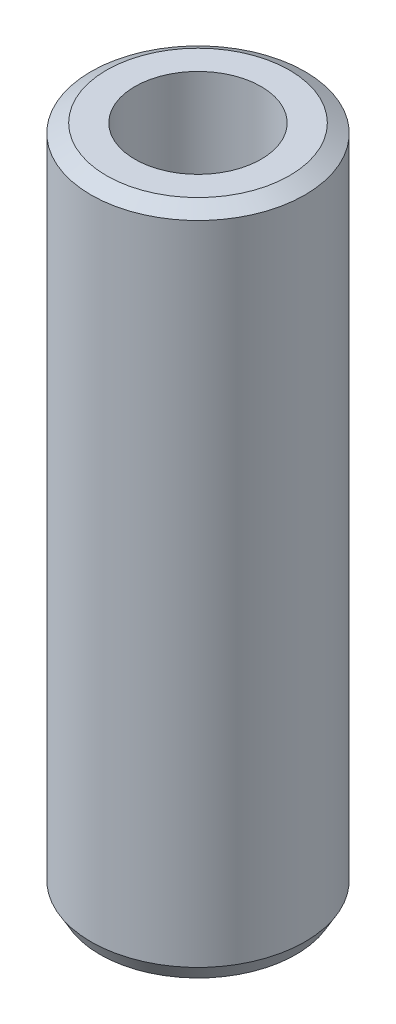
ISO-10303-21;
HEADER;
FILE_DESCRIPTION(('STEP AP214'),'2;1');
FILE_NAME('part.step','',(''),(''),'','','');
FILE_SCHEMA(('AUTOMOTIVE_DESIGN { 1 0 10303 214 1 1 1 1 }'));
ENDSEC;
DATA;
#1=APPLICATION_CONTEXT('core data for automotive mechanical design processes');
#2=APPLICATION_PROTOCOL_DEFINITION('international standard','automotive_design',2000,#1);
#3=PRODUCT_CONTEXT('',#1,'mechanical');
#4=PRODUCT('Part','Part','',(#3));
#5=PRODUCT_RELATED_PRODUCT_CATEGORY('part','',(#4));
#6=PRODUCT_DEFINITION_FORMATION('','',#4);
#7=PRODUCT_DEFINITION_CONTEXT('part definition',#1,'design');
#8=PRODUCT_DEFINITION('design','',#6,#7);
#9=PRODUCT_DEFINITION_SHAPE('','',#8);
#10=(LENGTH_UNIT() NAMED_UNIT(*) SI_UNIT(.MILLI.,.METRE.));
#11=(NAMED_UNIT(*) PLANE_ANGLE_UNIT() SI_UNIT($,.RADIAN.));
#12=(NAMED_UNIT(*) SI_UNIT($,.STERADIAN.) SOLID_ANGLE_UNIT());
#13=UNCERTAINTY_MEASURE_WITH_UNIT(LENGTH_MEASURE(1.E-05),#10,'distance_accuracy_value','');
#14=(GEOMETRIC_REPRESENTATION_CONTEXT(3) GLOBAL_UNCERTAINTY_ASSIGNED_CONTEXT((#13)) GLOBAL_UNIT_ASSIGNED_CONTEXT((#10,
#11,#12)) REPRESENTATION_CONTEXT('',''));
#15=CARTESIAN_POINT('',(0.,0.,0.));
#16=DIRECTION('',(0.,0.,1.));
#17=DIRECTION('',(1.,0.,0.));
#18=AXIS2_PLACEMENT_3D('',#15,#16,#17);
#19=CARTESIAN_POINT('',(0.,376.550034024088,0.));
#20=DIRECTION('',(0.,-1.,0.));
#21=DIRECTION('',(0.,0.,-1.));
#22=AXIS2_PLACEMENT_3D('',#19,#20,#21);
#23=CYLINDRICAL_SURFACE('',#22,60.);
#24=CARTESIAN_POINT('',(0.,371.536651698414,0.));
#25=DIRECTION('',(0.,1.,0.));
#26=DIRECTION('',(0.,0.,1.));
#27=AXIS2_PLACEMENT_3D('',#24,#25,#26);
#28=CIRCLE('',#27,60.);
#29=CARTESIAN_POINT('',(0.,371.536651698413,-60.));
#30=VERTEX_POINT('',#29);
#31=EDGE_CURVE('E50',#30,#30,#28,.F.);
#32=CARTESIAN_POINT('',(0.,8.68343290583662,0.));
#33=DIRECTION('',(0.,1.,0.));
#34=DIRECTION('',(0.,0.,1.));
#35=AXIS2_PLACEMENT_3D('',#32,#33,#34);
#36=CIRCLE('',#35,60.);
#37=CARTESIAN_POINT('',(0.,8.68343290583656,-60.));
#38=VERTEX_POINT('',#37);
#39=EDGE_CURVE('E51',#38,#38,#36,.T.);
#40=CARTESIAN_POINT('',(0.,371.536651698413,-60.));
#41=CARTESIAN_POINT('',(0.,367.756930669324,-60.));
#42=CARTESIAN_POINT('',(0.,363.977209640235,-60.));
#43=CARTESIAN_POINT('',(0.,356.417767582056,-60.));
#44=CARTESIAN_POINT('',(0.,352.638046552967,-60.));
#45=CARTESIAN_POINT('',(0.,345.078604494788,-60.));
#46=CARTESIAN_POINT('',(0.,341.298883465699,-60.));
#47=CARTESIAN_POINT('',(0.,333.73944140752,-60.));
#48=CARTESIAN_POINT('',(0.,329.959720378431,-60.));
#49=CARTESIAN_POINT('',(0.,322.400278320252,-60.));
#50=CARTESIAN_POINT('',(0.,318.620557291163,-60.));
#51=CARTESIAN_POINT('',(0.,311.061115232984,-60.));
#52=CARTESIAN_POINT('',(0.,307.281394203895,-60.));
#53=CARTESIAN_POINT('',(0.,299.721952145716,-60.));
#54=CARTESIAN_POINT('',(0.,295.942231116627,-60.));
#55=CARTESIAN_POINT('',(0.,288.382789058448,-60.));
#56=CARTESIAN_POINT('',(0.,284.603068029359,-60.));
#57=CARTESIAN_POINT('',(0.,277.04362597118,-60.));
#58=CARTESIAN_POINT('',(0.,273.263904942091,-60.));
#59=CARTESIAN_POINT('',(0.,265.704462883912,-60.));
#60=CARTESIAN_POINT('',(0.,261.924741854823,-60.));
#61=CARTESIAN_POINT('',(0.,254.365299796644,-60.));
#62=CARTESIAN_POINT('',(0.,250.585578767555,-60.));
#63=CARTESIAN_POINT('',(0.,243.026136709376,-60.));
#64=CARTESIAN_POINT('',(0.,239.246415680287,-60.));
#65=CARTESIAN_POINT('',(0.,231.686973622108,-60.));
#66=CARTESIAN_POINT('',(0.,227.907252593019,-60.));
#67=CARTESIAN_POINT('',(0.,220.34781053484,-60.));
#68=CARTESIAN_POINT('',(0.,216.56808950575,-60.));
#69=CARTESIAN_POINT('',(0.,209.008647447572,-60.));
#70=CARTESIAN_POINT('',(0.,205.228926418482,-60.));
#71=CARTESIAN_POINT('',(0.,197.669484360304,-60.));
#72=CARTESIAN_POINT('',(0.,193.889763331214,-60.));
#73=CARTESIAN_POINT('',(0.,186.330321273036,-60.));
#74=CARTESIAN_POINT('',(0.,182.550600243946,-60.));
#75=CARTESIAN_POINT('',(0.,174.991158185768,-60.));
#76=CARTESIAN_POINT('',(0.,171.211437156678,-60.));
#77=CARTESIAN_POINT('',(0.,163.6519950985,-60.));
#78=CARTESIAN_POINT('',(0.,159.87227406941,-60.));
#79=CARTESIAN_POINT('',(0.,152.312832011232,-60.));
#80=CARTESIAN_POINT('',(0.,148.533110982142,-60.));
#81=CARTESIAN_POINT('',(0.,140.973668923964,-60.));
#82=CARTESIAN_POINT('',(0.,137.193947894874,-60.));
#83=CARTESIAN_POINT('',(0.,129.634505836696,-60.));
#84=CARTESIAN_POINT('',(0.,125.854784807606,-60.));
#85=CARTESIAN_POINT('',(0.,118.295342749428,-60.));
#86=CARTESIAN_POINT('',(0.,114.515621720338,-60.));
#87=CARTESIAN_POINT('',(0.,106.956179662159,-60.));
#88=CARTESIAN_POINT('',(0.,103.17645863307,-60.));
#89=CARTESIAN_POINT('',(0.,95.6170165748915,-60.));
#90=CARTESIAN_POINT('',(0.,91.8372955458021,-60.));
#91=CARTESIAN_POINT('',(0.,84.2778534876234,-60.));
#92=CARTESIAN_POINT('',(0.,80.4981324585341,-60.));
#93=CARTESIAN_POINT('',(0.,72.9386904003554,-60.));
#94=CARTESIAN_POINT('',(0.,69.1589693712661,-60.));
#95=CARTESIAN_POINT('',(0.,61.5995273130874,-60.));
#96=CARTESIAN_POINT('',(0.,57.819806283998,-60.));
#97=CARTESIAN_POINT('',(0.,50.2603642258193,-60.));
#98=CARTESIAN_POINT('',(0.,46.48064319673,-60.));
#99=CARTESIAN_POINT('',(0.,38.9212011385513,-60.));
#100=CARTESIAN_POINT('',(0.,35.141480109462,-60.));
#101=CARTESIAN_POINT('',(0.,27.5820380512833,-60.));
#102=CARTESIAN_POINT('',(0.,23.8023170221939,-60.));
#103=CARTESIAN_POINT('',(0.,16.2428749640152,-60.));
#104=CARTESIAN_POINT('',(0.,12.4631539349259,-60.));
#105=CARTESIAN_POINT('',(0.,8.68343290583656,-60.));
#106=B_SPLINE_CURVE_WITH_KNOTS('',3,(#40,#41,#42,#43,#44,#45,#46,#47,#48,#49,#50,#51,#52,#53,
#54,#55,#56,#57,#58,#59,#60,#61,#62,#63,#64,#65,#66,#67,#68,#69,#70,#71,#72,#73,#74,#75,#76,#77,
#78,#79,#80,#81,#82,#83,#84,#85,#86,#87,#88,#89,#90,#91,#92,#93,#94,#95,#96,#97,#98,#99,#100,
#101,#102,#103,#104,#105),.UNSPECIFIED.,.F.,.F.,(4,2,2,2,2,2,2,2,2,2,2,2,2,2,2,2,2,2,2,2,2,2,2,
2,2,2,2,2,2,2,2,2,4),(0.,11.339163087268,22.678326174536,34.017489261804,45.3566523490721,
56.6958154363401,68.0349785236081,79.3741416108762,90.7133046981442,102.052467785412,
113.39163087268,124.730793959948,136.069957047216,147.409120134484,158.748283221752,
170.08744630902,181.426609396288,192.765772483556,204.104935570824,215.444098658093,
226.783261745361,238.122424832629,249.461587919897,260.800751007165,272.139914094433,
283.479077181701,294.818240268969,306.157403356237,317.496566443505,328.835729530773,
340.174892618041,351.514055705309,362.853218792577),.UNSPECIFIED.);
#107=EDGE_CURVE('BSEAM39',#30,#38,#106,.T.);
#108=ORIENTED_EDGE('',*,*,#31,.T.);
#109=ORIENTED_EDGE('',*,*,#39,.T.);
#110=ORIENTED_EDGE('',*,*,#107,.T.);
#111=ORIENTED_EDGE('',*,*,#107,.F.);
#112=EDGE_LOOP('',(#108,#110,#109,#111));
#113=FACE_BOUND('',#112,.T.);
#114=ADVANCED_FACE('F39',(#113),#23,.T.);
#115=CARTESIAN_POINT('',(0.,376.550034024088,0.));
#116=DIRECTION('',(0.,1.,0.));
#117=DIRECTION('',(0.,0.,1.));
#118=AXIS2_PLACEMENT_3D('',#115,#116,#117);
#119=PLANE('',#118);
#120=CARTESIAN_POINT('',(0.,376.550034024088,0.));
#121=DIRECTION('',(0.,1.,0.));
#122=DIRECTION('',(0.,0.,1.));
#123=AXIS2_PLACEMENT_3D('',#120,#121,#122);
#124=CIRCLE('',#123,51.3165670941642);
#125=CARTESIAN_POINT('',(0.,376.550034024088,-51.3165670941642));
#126=VERTEX_POINT('',#125);
#127=EDGE_CURVE('E54',#126,#126,#124,.T.);
#128=ORIENTED_EDGE('',*,*,#127,.T.);
#129=EDGE_LOOP('',(#128));
#130=FACE_BOUND('',#129,.T.);
#131=CARTESIAN_POINT('',(0.,376.550034024088,0.));
#132=DIRECTION('',(0.,1.,0.));
#133=DIRECTION('',(0.,0.,1.));
#134=AXIS2_PLACEMENT_3D('',#131,#132,#133);
#135=CIRCLE('',#134,35.3905438292616);
#136=CARTESIAN_POINT('',(0.,376.550034024088,-35.3905438292616));
#137=VERTEX_POINT('',#136);
#138=EDGE_CURVE('E58',#137,#137,#135,.T.);
#139=ORIENTED_EDGE('',*,*,#138,.F.);
#140=EDGE_LOOP('',(#139));
#141=FACE_BOUND('',#140,.T.);
#142=ADVANCED_FACE('F69',(#130,#141),#119,.T.);
#143=CARTESIAN_POINT('',(0.,0.,0.));
#144=DIRECTION('',(0.,1.,0.));
#145=DIRECTION('',(0.,0.,1.));
#146=AXIS2_PLACEMENT_3D('',#143,#144,#145);
#147=PLANE('',#146);
#148=CARTESIAN_POINT('',(0.,0.,0.));
#149=DIRECTION('',(0.,1.,0.));
#150=DIRECTION('',(0.,0.,1.));
#151=AXIS2_PLACEMENT_3D('',#148,#149,#150);
#152=CIRCLE('',#151,54.9866176743252);
#153=CARTESIAN_POINT('',(0.,0.,54.9866176743252));
#154=VERTEX_POINT('',#153);
#155=EDGE_CURVE('E10',#154,#154,#152,.F.);
#156=ORIENTED_EDGE('',*,*,#155,.T.);
#157=EDGE_LOOP('',(#156));
#158=FACE_BOUND('',#157,.T.);
#159=CARTESIAN_POINT('',(0.,0.,0.));
#160=DIRECTION('',(0.,1.,0.));
#161=DIRECTION('',(0.,0.,1.));
#162=AXIS2_PLACEMENT_3D('',#159,#160,#161);
#163=CIRCLE('',#162,35.3905438292616);
#164=CARTESIAN_POINT('',(0.,0.,-35.3905438292616));
#165=VERTEX_POINT('',#164);
#166=EDGE_CURVE('E63',#165,#165,#163,.T.);
#167=ORIENTED_EDGE('',*,*,#166,.T.);
#168=EDGE_LOOP('',(#167));
#169=FACE_BOUND('',#168,.T.);
#170=ADVANCED_FACE('F75',(#158,#169),#147,.F.);
#171=CARTESIAN_POINT('',(0.,376.550034024088,0.));
#172=DIRECTION('',(0.,-1.,0.));
#173=DIRECTION('',(0.,0.,-1.));
#174=AXIS2_PLACEMENT_3D('',#171,#172,#173);
#175=CYLINDRICAL_SURFACE('',#174,35.3905438292616);
#176=CARTESIAN_POINT('',(0.,376.550034024088,-35.3905438292616));
#177=CARTESIAN_POINT('',(0.,372.627637836337,-35.3905438292616));
#178=CARTESIAN_POINT('',(0.,368.705241648586,-35.3905438292616));
#179=CARTESIAN_POINT('',(0.,360.860449273084,-35.3905438292616));
#180=CARTESIAN_POINT('',(0.,356.938053085333,-35.3905438292616));
#181=CARTESIAN_POINT('',(0.,349.093260709831,-35.3905438292616));
#182=CARTESIAN_POINT('',(0.,345.170864522081,-35.3905438292616));
#183=CARTESIAN_POINT('',(0.,337.326072146579,-35.3905438292616));
#184=CARTESIAN_POINT('',(0.,333.403675958828,-35.3905438292616));
#185=CARTESIAN_POINT('',(0.,325.558883583326,-35.3905438292616));
#186=CARTESIAN_POINT('',(0.,321.636487395575,-35.3905438292616));
#187=CARTESIAN_POINT('',(0.,313.791695020073,-35.3905438292616));
#188=CARTESIAN_POINT('',(0.,309.869298832322,-35.3905438292616));
#189=CARTESIAN_POINT('',(0.,302.024506456821,-35.3905438292616));
#190=CARTESIAN_POINT('',(0.,298.10211026907,-35.3905438292616));
#191=CARTESIAN_POINT('',(0.,290.257317893568,-35.3905438292616));
#192=CARTESIAN_POINT('',(0.,286.334921705817,-35.3905438292616));
#193=CARTESIAN_POINT('',(0.,278.490129330315,-35.3905438292616));
#194=CARTESIAN_POINT('',(0.,274.567733142564,-35.3905438292616));
#195=CARTESIAN_POINT('',(0.,266.722940767062,-35.3905438292616));
#196=CARTESIAN_POINT('',(0.,262.800544579311,-35.3905438292616));
#197=CARTESIAN_POINT('',(0.,254.95575220381,-35.3905438292616));
#198=CARTESIAN_POINT('',(0.,251.033356016059,-35.3905438292616));
#199=CARTESIAN_POINT('',(0.,243.188563640557,-35.3905438292616));
#200=CARTESIAN_POINT('',(0.,239.266167452806,-35.3905438292616));
#201=CARTESIAN_POINT('',(0.,231.421375077304,-35.3905438292616));
#202=CARTESIAN_POINT('',(0.,227.498978889553,-35.3905438292616));
#203=CARTESIAN_POINT('',(0.,219.654186514051,-35.3905438292616));
#204=CARTESIAN_POINT('',(0.,215.7317903263,-35.3905438292616));
#205=CARTESIAN_POINT('',(0.,207.886997950798,-35.3905438292616));
#206=CARTESIAN_POINT('',(0.,203.964601763048,-35.3905438292616));
#207=CARTESIAN_POINT('',(0.,196.119809387546,-35.3905438292616));
#208=CARTESIAN_POINT('',(0.,192.197413199795,-35.3905438292616));
#209=CARTESIAN_POINT('',(0.,184.352620824293,-35.3905438292616));
#210=CARTESIAN_POINT('',(0.,180.430224636542,-35.3905438292616));
#211=CARTESIAN_POINT('',(0.,172.58543226104,-35.3905438292616));
#212=CARTESIAN_POINT('',(0.,168.663036073289,-35.3905438292616));
#213=CARTESIAN_POINT('',(0.,160.818243697787,-35.3905438292616));
#214=CARTESIAN_POINT('',(0.,156.895847510037,-35.3905438292616));
#215=CARTESIAN_POINT('',(0.,149.051055134535,-35.3905438292616));
#216=CARTESIAN_POINT('',(0.,145.128658946784,-35.3905438292616));
#217=CARTESIAN_POINT('',(0.,137.283866571282,-35.3905438292616));
#218=CARTESIAN_POINT('',(0.,133.361470383531,-35.3905438292616));
#219=CARTESIAN_POINT('',(0.,125.516678008029,-35.3905438292616));
#220=CARTESIAN_POINT('',(0.,121.594281820278,-35.3905438292616));
#221=CARTESIAN_POINT('',(0.,113.749489444777,-35.3905438292616));
#222=CARTESIAN_POINT('',(0.,109.827093257026,-35.3905438292616));
#223=CARTESIAN_POINT('',(0.,101.982300881524,-35.3905438292616));
#224=CARTESIAN_POINT('',(0.,98.0599046937729,-35.3905438292616));
#225=CARTESIAN_POINT('',(0.,90.215112318271,-35.3905438292616));
#226=CARTESIAN_POINT('',(0.,86.2927161305201,-35.3905438292616));
#227=CARTESIAN_POINT('',(0.,78.4479237550183,-35.3905438292616));
#228=CARTESIAN_POINT('',(0.,74.5255275672674,-35.3905438292616));
#229=CARTESIAN_POINT('',(0.,66.6807351917655,-35.3905438292616));
#230=CARTESIAN_POINT('',(0.,62.7583390040146,-35.3905438292616));
#231=CARTESIAN_POINT('',(0.,54.9135466285128,-35.3905438292616));
#232=CARTESIAN_POINT('',(0.,50.9911504407619,-35.3905438292616));
#233=CARTESIAN_POINT('',(0.,43.14635806526,-35.3905438292616));
#234=CARTESIAN_POINT('',(0.,39.2239618775091,-35.3905438292616));
#235=CARTESIAN_POINT('',(0.,31.3791695020073,-35.3905438292616));
#236=CARTESIAN_POINT('',(0.,27.4567733142564,-35.3905438292616));
#237=CARTESIAN_POINT('',(0.,19.6119809387545,-35.3905438292616));
#238=CARTESIAN_POINT('',(0.,15.6895847510036,-35.3905438292616));
#239=CARTESIAN_POINT('',(0.,7.84479237550178,-35.3905438292616));
#240=CARTESIAN_POINT('',(0.,3.92239618775086,-35.3905438292616));
#241=CARTESIAN_POINT('',(0.,0.,-35.3905438292616));
#242=B_SPLINE_CURVE_WITH_KNOTS('',3,(#176,#177,#178,#179,#180,#181,#182,#183,#184,#185,#186,
#187,#188,#189,#190,#191,#192,#193,#194,#195,#196,#197,#198,#199,#200,#201,#202,#203,#204,#205,
#206,#207,#208,#209,#210,#211,#212,#213,#214,#215,#216,#217,#218,#219,#220,#221,#222,#223,#224,
#225,#226,#227,#228,#229,#230,#231,#232,#233,#234,#235,#236,#237,#238,#239,#240,#241),
.UNSPECIFIED.,.F.,.F.,(4,2,2,2,2,2,2,2,2,2,2,2,2,2,2,2,2,2,2,2,2,2,2,2,2,2,2,2,2,2,2,2,4),(0.,
11.7671885632528,23.5343771265055,35.3015656897583,47.0687542530111,58.8359428162638,
70.6031313795165,82.3703199427693,94.137508506022,105.904697069275,117.671885632528,
129.43907419578,141.206262759033,152.973451322286,164.740639885539,176.507828448791,
188.275017012044,200.042205575297,211.80939413855,223.576582701802,235.343771265055,
247.110959828308,258.878148391561,270.645336954813,282.412525518066,294.179714081319,
305.946902644571,317.714091207824,329.481279771077,341.24846833433,353.015656897582,
364.782845460835,376.550034024088),.UNSPECIFIED.);
#243=EDGE_CURVE('BSEAM70',#137,#165,#242,.T.);
#244=ORIENTED_EDGE('',*,*,#138,.T.);
#245=ORIENTED_EDGE('',*,*,#166,.F.);
#246=ORIENTED_EDGE('',*,*,#243,.T.);
#247=ORIENTED_EDGE('',*,*,#243,.F.);
#248=EDGE_LOOP('',(#244,#246,#245,#247));
#249=FACE_BOUND('',#248,.T.);
#250=ADVANCED_FACE('F70',(#249),#175,.F.);
#251=CARTESIAN_POINT('',(0.,376.550034024088,0.));
#252=DIRECTION('',(0.,-1.,0.));
#253=DIRECTION('',(0.,0.,-1.));
#254=AXIS2_PLACEMENT_3D('',#251,#252,#253);
#255=CONICAL_SURFACE('',#254,51.3165670941642,1.04719755119659);
#256=CARTESIAN_POINT('',(0.,371.536651698413,-60.));
#257=CARTESIAN_POINT('',(0.,371.588874430973,-59.9095475738976));
#258=CARTESIAN_POINT('',(0.,371.641097163532,-59.8190951477951));
#259=CARTESIAN_POINT('',(0.,371.74554262865,-59.6381902955902));
#260=CARTESIAN_POINT('',(0.,371.797765361209,-59.5477378694878));
#261=CARTESIAN_POINT('',(0.,371.902210826327,-59.3668330172829));
#262=CARTESIAN_POINT('',(0.,371.954433558886,-59.2763805911804));
#263=CARTESIAN_POINT('',(0.,372.058879024005,-59.0954757389755));
#264=CARTESIAN_POINT('',(0.,372.111101756564,-59.005023312873));
#265=CARTESIAN_POINT('',(0.,372.215547221682,-58.8241184606681));
#266=CARTESIAN_POINT('',(0.,372.267769954241,-58.7336660345657));
#267=CARTESIAN_POINT('',(0.,372.372215419359,-58.5527611823607));
#268=CARTESIAN_POINT('',(0.,372.424438151918,-58.4623087562583));
#269=CARTESIAN_POINT('',(0.,372.528883617037,-58.2814039040534));
#270=CARTESIAN_POINT('',(0.,372.581106349596,-58.1909514779509));
#271=CARTESIAN_POINT('',(0.,372.685551814714,-58.010046625746));
#272=CARTESIAN_POINT('',(0.,372.737774547273,-57.9195941996436));
#273=CARTESIAN_POINT('',(0.,372.842220012391,-57.7386893474386));
#274=CARTESIAN_POINT('',(0.,372.89444274495,-57.6482369213362));
#275=CARTESIAN_POINT('',(0.,372.998888210069,-57.4673320691313));
#276=CARTESIAN_POINT('',(0.,373.051110942628,-57.3768796430288));
#277=CARTESIAN_POINT('',(0.,373.155556407746,-57.1959747908239));
#278=CARTESIAN_POINT('',(0.,373.207779140305,-57.1055223647214));
#279=CARTESIAN_POINT('',(0.,373.312224605423,-56.9246175125165));
#280=CARTESIAN_POINT('',(0.,373.364447337982,-56.8341650864141));
#281=CARTESIAN_POINT('',(0.,373.468892803101,-56.6532602342092));
#282=CARTESIAN_POINT('',(0.,373.52111553566,-56.5628078081067));
#283=CARTESIAN_POINT('',(0.,373.625561000778,-56.3819029559018));
#284=CARTESIAN_POINT('',(0.,373.677783733337,-56.2914505297993));
#285=CARTESIAN_POINT('',(0.,373.782229198455,-56.1105456775944));
#286=CARTESIAN_POINT('',(0.,373.834451931014,-56.020093251492));
#287=CARTESIAN_POINT('',(0.,373.938897396133,-55.8391883992871));
#288=CARTESIAN_POINT('',(0.,373.991120128692,-55.7487359731846));
#289=CARTESIAN_POINT('',(0.,374.09556559381,-55.5678311209797));
#290=CARTESIAN_POINT('',(0.,374.147788326369,-55.4773786948772));
#291=CARTESIAN_POINT('',(0.,374.252233791487,-55.2964738426723));
#292=CARTESIAN_POINT('',(0.,374.304456524046,-55.2060214165699));
#293=CARTESIAN_POINT('',(0.,374.408901989164,-55.025116564365));
#294=CARTESIAN_POINT('',(0.,374.461124721724,-54.9346641382625));
#295=CARTESIAN_POINT('',(0.,374.565570186842,-54.7537592860576));
#296=CARTESIAN_POINT('',(0.,374.617792919401,-54.6633068599551));
#297=CARTESIAN_POINT('',(0.,374.722238384519,-54.4824020077502));
#298=CARTESIAN_POINT('',(0.,374.774461117078,-54.3919495816478));
#299=CARTESIAN_POINT('',(0.,374.878906582196,-54.2110447294428));
#300=CARTESIAN_POINT('',(0.,374.931129314756,-54.1205923033404));
#301=CARTESIAN_POINT('',(0.,375.035574779874,-53.9396874511355));
#302=CARTESIAN_POINT('',(0.,375.087797512433,-53.849235025033));
#303=CARTESIAN_POINT('',(0.,375.192242977551,-53.6683301728281));
#304=CARTESIAN_POINT('',(0.,375.24446571011,-53.5778777467256));
#305=CARTESIAN_POINT('',(0.,375.348911175228,-53.3969728945207));
#306=CARTESIAN_POINT('',(0.,375.401133907787,-53.3065204684183));
#307=CARTESIAN_POINT('',(0.,375.505579372906,-53.1256156162134));
#308=CARTESIAN_POINT('',(0.,375.557802105465,-53.0351631901109));
#309=CARTESIAN_POINT('',(0.,375.662247570583,-52.854258337906));
#310=CARTESIAN_POINT('',(0.,375.714470303142,-52.7638059118035));
#311=CARTESIAN_POINT('',(0.,375.81891576826,-52.5829010595986));
#312=CARTESIAN_POINT('',(0.,375.871138500819,-52.4924486334962));
#313=CARTESIAN_POINT('',(0.,375.975583965938,-52.3115437812913));
#314=CARTESIAN_POINT('',(0.,376.027806698497,-52.2210913551888));
#315=CARTESIAN_POINT('',(0.,376.132252163615,-52.0401865029839));
#316=CARTESIAN_POINT('',(0.,376.184474896174,-51.9497340768814));
#317=CARTESIAN_POINT('',(0.,376.288920361292,-51.7688292246765));
#318=CARTESIAN_POINT('',(0.,376.341143093851,-51.6783767985741));
#319=CARTESIAN_POINT('',(0.,376.44558855897,-51.4974719463692));
#320=CARTESIAN_POINT('',(0.,376.497811291529,-51.4070195202667));
#321=CARTESIAN_POINT('',(0.,376.550034024088,-51.3165670941642));
#322=B_SPLINE_CURVE_WITH_KNOTS('',3,(#256,#257,#258,#259,#260,#261,#262,#263,#264,#265,#266,
#267,#268,#269,#270,#271,#272,#273,#274,#275,#276,#277,#278,#279,#280,#281,#282,#283,#284,#285,
#286,#287,#288,#289,#290,#291,#292,#293,#294,#295,#296,#297,#298,#299,#300,#301,#302,#303,#304,
#305,#306,#307,#308,#309,#310,#311,#312,#313,#314,#315,#316,#317,#318,#319,#320,#321),
.UNSPECIFIED.,.F.,.F.,(4,2,2,2,2,2,2,2,2,2,2,2,2,2,2,2,2,2,2,2,2,2,2,2,2,2,2,2,2,2,2,2,4),(0.,
0.313336395354659,0.626672790709312,0.940009186063944,1.2533455814186,1.56668197677326,
1.88001837212789,2.19335476748255,2.50669116283718,2.82002755819184,3.1333639535465,
3.44670034890113,3.76003674425579,4.07337313961045,4.38670953496507,4.70004593031973,
5.01338232567436,5.32671872102902,5.64005511638368,5.95339151173831,6.26672790709297,
6.58006430244763,6.89340069780226,7.20673709315692,7.52007348851154,7.8334098838662,
8.14674627922086,8.46008267457549,8.77341906993015,9.08675546528481,9.40009186063944,
9.7134282559941,10.0267646513488),.UNSPECIFIED.);
#323=EDGE_CURVE('BSEAM81',#30,#126,#322,.T.);
#324=ORIENTED_EDGE('',*,*,#31,.F.);
#325=ORIENTED_EDGE('',*,*,#127,.F.);
#326=ORIENTED_EDGE('',*,*,#323,.T.);
#327=ORIENTED_EDGE('',*,*,#323,.F.);
#328=EDGE_LOOP('',(#324,#326,#325,#327));
#329=FACE_BOUND('',#328,.T.);
#330=ADVANCED_FACE('F81',(#329),#255,.T.);
#331=CARTESIAN_POINT('',(0.,8.68343290583662,0.));
#332=DIRECTION('',(0.,1.,0.));
#333=DIRECTION('',(0.,0.,1.));
#334=AXIS2_PLACEMENT_3D('',#331,#332,#333);
#335=CONICAL_SURFACE('',#334,60.,0.5235987755983);
#336=ORIENTED_EDGE('',*,*,#155,.F.);
#337=EDGE_LOOP('',(#336));
#338=FACE_BOUND('',#337,.T.);
#339=ORIENTED_EDGE('',*,*,#39,.F.);
#340=EDGE_LOOP('',(#339));
#341=FACE_BOUND('',#340,.T.);
#342=ADVANCED_FACE('F45',(#338,#341),#335,.T.);
#343=CLOSED_SHELL('',(#114,#142,#170,#250,#330,#342));
#344=MANIFOLD_SOLID_BREP('B2',#343);
#345=ADVANCED_BREP_SHAPE_REPRESENTATION('',(#18,#344),#14);
#346=SHAPE_DEFINITION_REPRESENTATION(#9,#345);
ENDSEC;
END-ISO-10303-21;
